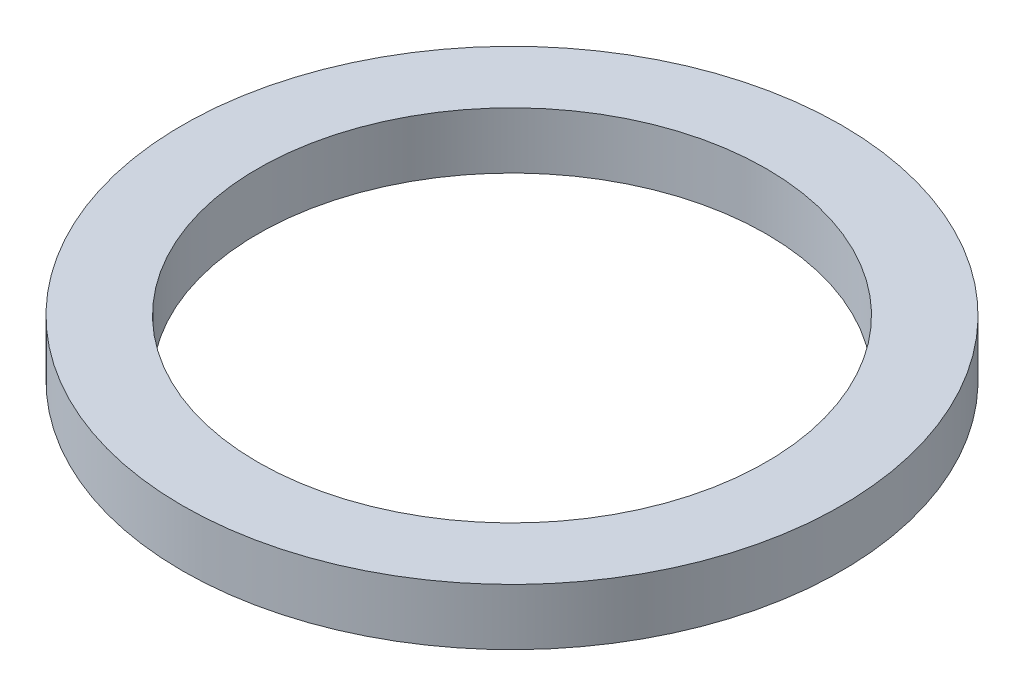
ISO-10303-21;
HEADER;
FILE_DESCRIPTION(('STEP AP214'),'2;1');
FILE_NAME('part.step','',(''),(''),'','','');
FILE_SCHEMA(('AUTOMOTIVE_DESIGN { 1 0 10303 214 1 1 1 1 }'));
ENDSEC;
DATA;
#1=APPLICATION_CONTEXT('core data for automotive mechanical design processes');
#2=APPLICATION_PROTOCOL_DEFINITION('international standard','automotive_design',2000,#1);
#3=PRODUCT_CONTEXT('',#1,'mechanical');
#4=PRODUCT('Part','Part','',(#3));
#5=PRODUCT_RELATED_PRODUCT_CATEGORY('part','',(#4));
#6=PRODUCT_DEFINITION_FORMATION('','',#4);
#7=PRODUCT_DEFINITION_CONTEXT('part definition',#1,'design');
#8=PRODUCT_DEFINITION('design','',#6,#7);
#9=PRODUCT_DEFINITION_SHAPE('','',#8);
#10=(LENGTH_UNIT() NAMED_UNIT(*) SI_UNIT(.MILLI.,.METRE.));
#11=(NAMED_UNIT(*) PLANE_ANGLE_UNIT() SI_UNIT($,.RADIAN.));
#12=(NAMED_UNIT(*) SI_UNIT($,.STERADIAN.) SOLID_ANGLE_UNIT());
#13=UNCERTAINTY_MEASURE_WITH_UNIT(LENGTH_MEASURE(1.E-05),#10,'distance_accuracy_value','');
#14=(GEOMETRIC_REPRESENTATION_CONTEXT(3) GLOBAL_UNCERTAINTY_ASSIGNED_CONTEXT((#13)) GLOBAL_UNIT_ASSIGNED_CONTEXT((#10,
#11,#12)) REPRESENTATION_CONTEXT('',''));
#15=CARTESIAN_POINT('',(0.,0.,0.));
#16=DIRECTION('',(0.,0.,1.));
#17=DIRECTION('',(1.,0.,0.));
#18=AXIS2_PLACEMENT_3D('',#15,#16,#17);
#19=CARTESIAN_POINT('',(0.,0.762,0.));
#20=DIRECTION('',(0.,1.,0.));
#21=DIRECTION('',(0.,0.,1.));
#22=AXIS2_PLACEMENT_3D('',#19,#20,#21);
#23=PLANE('',#22);
#24=CARTESIAN_POINT('',(0.,0.762,0.));
#25=DIRECTION('',(0.,1.,0.));
#26=DIRECTION('',(0.,0.,1.));
#27=AXIS2_PLACEMENT_3D('',#24,#25,#26);
#28=CIRCLE('',#27,4.445);
#29=CARTESIAN_POINT('',(0.,0.762,4.445));
#30=VERTEX_POINT('',#29);
#31=EDGE_CURVE('E10',#30,#30,#28,.T.);
#32=ORIENTED_EDGE('',*,*,#31,.T.);
#33=EDGE_LOOP('',(#32));
#34=FACE_BOUND('',#33,.T.);
#35=CARTESIAN_POINT('',(0.,0.762,0.));
#36=DIRECTION('',(0.,1.,0.));
#37=DIRECTION('',(0.,0.,1.));
#38=AXIS2_PLACEMENT_3D('',#35,#36,#37);
#39=CIRCLE('',#38,3.429);
#40=CARTESIAN_POINT('',(0.,0.762,3.429));
#41=VERTEX_POINT('',#40);
#42=EDGE_CURVE('E50',#41,#41,#39,.T.);
#43=ORIENTED_EDGE('',*,*,#42,.F.);
#44=EDGE_LOOP('',(#43));
#45=FACE_BOUND('',#44,.T.);
#46=ADVANCED_FACE('F37',(#34,#45),#23,.T.);
#47=CARTESIAN_POINT('',(0.,0.,0.));
#48=DIRECTION('',(0.,1.,0.));
#49=DIRECTION('',(0.,0.,1.));
#50=AXIS2_PLACEMENT_3D('',#47,#48,#49);
#51=PLANE('',#50);
#52=CARTESIAN_POINT('',(0.,0.,0.));
#53=DIRECTION('',(0.,1.,0.));
#54=DIRECTION('',(0.,0.,1.));
#55=AXIS2_PLACEMENT_3D('',#52,#53,#54);
#56=CIRCLE('',#55,4.445);
#57=CARTESIAN_POINT('',(0.,0.,4.445));
#58=VERTEX_POINT('',#57);
#59=EDGE_CURVE('E41',#58,#58,#56,.T.);
#60=ORIENTED_EDGE('',*,*,#59,.F.);
#61=EDGE_LOOP('',(#60));
#62=FACE_BOUND('',#61,.T.);
#63=CARTESIAN_POINT('',(0.,0.,0.));
#64=DIRECTION('',(0.,1.,0.));
#65=DIRECTION('',(0.,0.,1.));
#66=AXIS2_PLACEMENT_3D('',#63,#64,#65);
#67=CIRCLE('',#66,3.429);
#68=CARTESIAN_POINT('',(0.,0.,3.429));
#69=VERTEX_POINT('',#68);
#70=EDGE_CURVE('E52',#69,#69,#67,.T.);
#71=ORIENTED_EDGE('',*,*,#70,.T.);
#72=EDGE_LOOP('',(#71));
#73=FACE_BOUND('',#72,.T.);
#74=ADVANCED_FACE('F64',(#62,#73),#51,.F.);
#75=CARTESIAN_POINT('',(0.,0.762,0.));
#76=DIRECTION('',(0.,-1.,0.));
#77=DIRECTION('',(0.,0.,-1.));
#78=AXIS2_PLACEMENT_3D('',#75,#76,#77);
#79=CYLINDRICAL_SURFACE('',#78,4.445);
#80=ORIENTED_EDGE('',*,*,#31,.F.);
#81=EDGE_LOOP('',(#80));
#82=FACE_BOUND('',#81,.T.);
#83=ORIENTED_EDGE('',*,*,#59,.T.);
#84=EDGE_LOOP('',(#83));
#85=FACE_BOUND('',#84,.T.);
#86=ADVANCED_FACE('F39',(#82,#85),#79,.T.);
#87=CARTESIAN_POINT('',(0.,0.762,0.));
#88=DIRECTION('',(0.,-1.,0.));
#89=DIRECTION('',(0.,0.,-1.));
#90=AXIS2_PLACEMENT_3D('',#87,#88,#89);
#91=CYLINDRICAL_SURFACE('',#90,3.429);
#92=ORIENTED_EDGE('',*,*,#42,.T.);
#93=EDGE_LOOP('',(#92));
#94=FACE_BOUND('',#93,.T.);
#95=ORIENTED_EDGE('',*,*,#70,.F.);
#96=EDGE_LOOP('',(#95));
#97=FACE_BOUND('',#96,.T.);
#98=ADVANCED_FACE('F60',(#94,#97),#91,.F.);
#99=CLOSED_SHELL('',(#46,#74,#86,#98));
#100=MANIFOLD_SOLID_BREP('B2',#99);
#101=ADVANCED_BREP_SHAPE_REPRESENTATION('',(#18,#100),#14);
#102=SHAPE_DEFINITION_REPRESENTATION(#9,#101);
ENDSEC;
END-ISO-10303-21;
